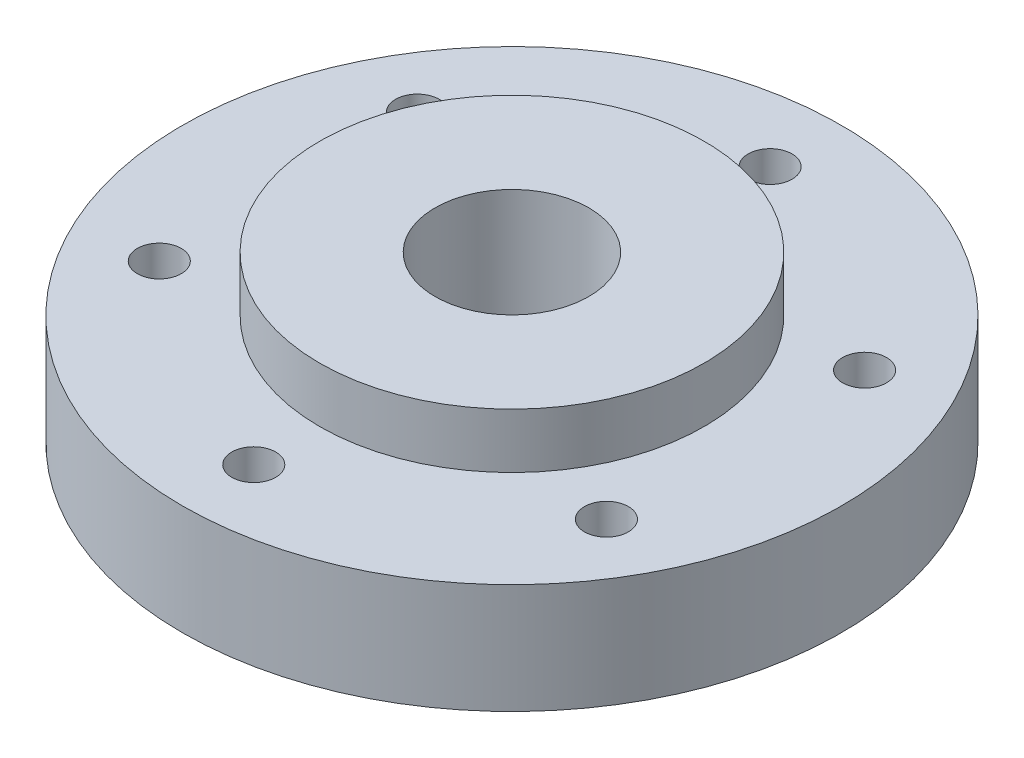
ISO-10303-21;
HEADER;
FILE_DESCRIPTION(('STEP AP214'),'2;1');
FILE_NAME('part.step','',(''),(''),'','','');
FILE_SCHEMA(('AUTOMOTIVE_DESIGN { 1 0 10303 214 1 1 1 1 }'));
ENDSEC;
DATA;
#1=APPLICATION_CONTEXT('core data for automotive mechanical design processes');
#2=APPLICATION_PROTOCOL_DEFINITION('international standard','automotive_design',2000,#1);
#3=PRODUCT_CONTEXT('',#1,'mechanical');
#4=PRODUCT('Part','Part','',(#3));
#5=PRODUCT_RELATED_PRODUCT_CATEGORY('part','',(#4));
#6=PRODUCT_DEFINITION_FORMATION('','',#4);
#7=PRODUCT_DEFINITION_CONTEXT('part definition',#1,'design');
#8=PRODUCT_DEFINITION('design','',#6,#7);
#9=PRODUCT_DEFINITION_SHAPE('','',#8);
#10=(LENGTH_UNIT() NAMED_UNIT(*) SI_UNIT(.MILLI.,.METRE.));
#11=(NAMED_UNIT(*) PLANE_ANGLE_UNIT() SI_UNIT($,.RADIAN.));
#12=(NAMED_UNIT(*) SI_UNIT($,.STERADIAN.) SOLID_ANGLE_UNIT());
#13=UNCERTAINTY_MEASURE_WITH_UNIT(LENGTH_MEASURE(1.E-05),#10,'distance_accuracy_value','');
#14=(GEOMETRIC_REPRESENTATION_CONTEXT(3) GLOBAL_UNCERTAINTY_ASSIGNED_CONTEXT((#13)) GLOBAL_UNIT_ASSIGNED_CONTEXT((#10,
#11,#12)) REPRESENTATION_CONTEXT('',''));
#15=CARTESIAN_POINT('',(0.,0.,0.));
#16=DIRECTION('',(0.,0.,1.));
#17=DIRECTION('',(1.,0.,0.));
#18=AXIS2_PLACEMENT_3D('',#15,#16,#17);
#19=CARTESIAN_POINT('',(0.,15.,0.));
#20=DIRECTION('',(0.,-1.,0.));
#21=DIRECTION('',(0.,0.,-1.));
#22=AXIS2_PLACEMENT_3D('',#19,#20,#21);
#23=CYLINDRICAL_SURFACE('',#22,30.);
#24=CARTESIAN_POINT('',(0.,0.,0.));
#25=DIRECTION('',(0.,1.,0.));
#26=DIRECTION('',(0.,0.,1.));
#27=AXIS2_PLACEMENT_3D('',#24,#25,#26);
#28=CIRCLE('',#27,30.);
#29=CARTESIAN_POINT('',(0.,0.,30.));
#30=VERTEX_POINT('',#29);
#31=EDGE_CURVE('E10',#30,#30,#28,.T.);
#32=ORIENTED_EDGE('',*,*,#31,.T.);
#33=EDGE_LOOP('',(#32));
#34=FACE_BOUND('',#33,.T.);
#35=CARTESIAN_POINT('',(0.,10.,0.));
#36=DIRECTION('',(0.,1.,0.));
#37=DIRECTION('',(0.,0.,1.));
#38=AXIS2_PLACEMENT_3D('',#35,#36,#37);
#39=CIRCLE('',#38,30.);
#40=CARTESIAN_POINT('',(0.,10.,30.));
#41=VERTEX_POINT('',#40);
#42=EDGE_CURVE('E53',#41,#41,#39,.T.);
#43=ORIENTED_EDGE('',*,*,#42,.F.);
#44=EDGE_LOOP('',(#43));
#45=FACE_BOUND('',#44,.T.);
#46=ADVANCED_FACE('F33',(#34,#45),#23,.T.);
#47=CARTESIAN_POINT('',(0.,15.,0.));
#48=DIRECTION('',(0.,1.,0.));
#49=DIRECTION('',(0.,0.,1.));
#50=AXIS2_PLACEMENT_3D('',#47,#48,#49);
#51=PLANE('',#50);
#52=CARTESIAN_POINT('',(0.,15.,0.));
#53=DIRECTION('',(0.,-1.,0.));
#54=DIRECTION('',(0.,0.,-1.));
#55=AXIS2_PLACEMENT_3D('',#52,#53,#54);
#56=CIRCLE('',#55,7.);
#57=CARTESIAN_POINT('',(0.,15.,-7.));
#58=VERTEX_POINT('',#57);
#59=EDGE_CURVE('E48',#58,#58,#56,.T.);
#60=ORIENTED_EDGE('',*,*,#59,.T.);
#61=EDGE_LOOP('',(#60));
#62=FACE_BOUND('',#61,.T.);
#63=CARTESIAN_POINT('',(0.,15.,0.));
#64=DIRECTION('',(0.,1.,0.));
#65=DIRECTION('',(0.,0.,1.));
#66=AXIS2_PLACEMENT_3D('',#63,#64,#65);
#67=CIRCLE('',#66,17.5);
#68=CARTESIAN_POINT('',(0.,15.,17.5));
#69=VERTEX_POINT('',#68);
#70=EDGE_CURVE('E59',#69,#69,#67,.T.);
#71=ORIENTED_EDGE('',*,*,#70,.T.);
#72=EDGE_LOOP('',(#71));
#73=FACE_BOUND('',#72,.T.);
#74=ADVANCED_FACE('F132',(#62,#73),#51,.T.);
#75=CARTESIAN_POINT('',(0.,0.,0.));
#76=DIRECTION('',(0.,1.,0.));
#77=DIRECTION('',(0.,0.,1.));
#78=AXIS2_PLACEMENT_3D('',#75,#76,#77);
#79=PLANE('',#78);
#80=CARTESIAN_POINT('',(20.3515969889348,0.,-11.7500000000009));
#81=DIRECTION('',(0.,1.,0.));
#82=DIRECTION('',(0.,0.,1.));
#83=AXIS2_PLACEMENT_3D('',#80,#81,#82);
#84=CIRCLE('',#83,2.00000000000028);
#85=CARTESIAN_POINT('',(20.3515969889348,0.,-9.75000000000058));
#86=VERTEX_POINT('',#85);
#87=EDGE_CURVE('E68',#86,#86,#84,.T.);
#88=ORIENTED_EDGE('',*,*,#87,.T.);
#89=EDGE_LOOP('',(#88));
#90=FACE_BOUND('',#89,.T.);
#91=CARTESIAN_POINT('',(20.3515969889358,0.,11.7499999999991));
#92=DIRECTION('',(0.,1.,0.));
#93=DIRECTION('',(0.,0.,1.));
#94=AXIS2_PLACEMENT_3D('',#91,#92,#93);
#95=CIRCLE('',#94,2.00000000000129);
#96=CARTESIAN_POINT('',(20.3515969889358,0.,13.7500000000004));
#97=VERTEX_POINT('',#96);
#98=EDGE_CURVE('E92',#97,#97,#95,.T.);
#99=ORIENTED_EDGE('',*,*,#98,.T.);
#100=EDGE_LOOP('',(#99));
#101=FACE_BOUND('',#100,.T.);
#102=CARTESIAN_POINT('',(1.99797467488749E-12,0.,23.5));
#103=DIRECTION('',(0.,1.,0.));
#104=DIRECTION('',(0.,0.,1.));
#105=AXIS2_PLACEMENT_3D('',#102,#103,#104);
#106=CIRCLE('',#105,2.00000000000207);
#107=CARTESIAN_POINT('',(1.99797467488749E-12,0.,25.5000000000021));
#108=VERTEX_POINT('',#107);
#109=EDGE_CURVE('E86',#108,#108,#106,.T.);
#110=ORIENTED_EDGE('',*,*,#109,.T.);
#111=EDGE_LOOP('',(#110));
#112=FACE_BOUND('',#111,.T.);
#113=CARTESIAN_POINT('',(-20.3515969889328,0.,11.7500000000009));
#114=DIRECTION('',(0.,1.,0.));
#115=DIRECTION('',(0.,0.,1.));
#116=AXIS2_PLACEMENT_3D('',#113,#114,#115);
#117=CIRCLE('',#116,2.0000000000019);
#118=CARTESIAN_POINT('',(-20.3515969889328,0.,13.7500000000028));
#119=VERTEX_POINT('',#118);
#120=EDGE_CURVE('E80',#119,#119,#117,.T.);
#121=ORIENTED_EDGE('',*,*,#120,.T.);
#122=EDGE_LOOP('',(#121));
#123=FACE_BOUND('',#122,.T.);
#124=CARTESIAN_POINT('',(-20.3515969889338,0.,-11.7499999999991));
#125=DIRECTION('',(0.,1.,0.));
#126=DIRECTION('',(0.,0.,1.));
#127=AXIS2_PLACEMENT_3D('',#124,#125,#126);
#128=CIRCLE('',#127,2.00000000000101);
#129=CARTESIAN_POINT('',(-20.3515969889338,0.,-9.74999999999811));
#130=VERTEX_POINT('',#129);
#131=EDGE_CURVE('E74',#130,#130,#128,.T.);
#132=ORIENTED_EDGE('',*,*,#131,.T.);
#133=EDGE_LOOP('',(#132));
#134=FACE_BOUND('',#133,.T.);
#135=CARTESIAN_POINT('',(0.,0.,-23.5));
#136=DIRECTION('',(0.,1.,0.));
#137=DIRECTION('',(0.,0.,1.));
#138=AXIS2_PLACEMENT_3D('',#135,#136,#137);
#139=CIRCLE('',#138,2.);
#140=CARTESIAN_POINT('',(0.,0.,-21.5));
#141=VERTEX_POINT('',#140);
#142=EDGE_CURVE('E62',#141,#141,#139,.T.);
#143=ORIENTED_EDGE('',*,*,#142,.T.);
#144=EDGE_LOOP('',(#143));
#145=FACE_BOUND('',#144,.T.);
#146=CARTESIAN_POINT('',(0.,0.,0.));
#147=DIRECTION('',(0.,-1.,0.));
#148=DIRECTION('',(0.,0.,-1.));
#149=AXIS2_PLACEMENT_3D('',#146,#147,#148);
#150=CIRCLE('',#149,16.25);
#151=CARTESIAN_POINT('',(0.,0.,-16.25));
#152=VERTEX_POINT('',#151);
#153=EDGE_CURVE('E43',#152,#152,#150,.T.);
#154=ORIENTED_EDGE('',*,*,#153,.F.);
#155=EDGE_LOOP('',(#154));
#156=FACE_BOUND('',#155,.T.);
#157=ORIENTED_EDGE('',*,*,#31,.F.);
#158=EDGE_LOOP('',(#157));
#159=FACE_BOUND('',#158,.T.);
#160=ADVANCED_FACE('F101',(#90,#101,#112,#123,#134,#145,#156,#159),#79,.F.);
#161=CARTESIAN_POINT('',(0.,5.,0.));
#162=DIRECTION('',(0.,-1.,0.));
#163=DIRECTION('',(0.,0.,-1.));
#164=AXIS2_PLACEMENT_3D('',#161,#162,#163);
#165=CYLINDRICAL_SURFACE('',#164,16.25);
#166=CARTESIAN_POINT('',(0.,5.,0.));
#167=DIRECTION('',(0.,-1.,0.));
#168=DIRECTION('',(0.,0.,-1.));
#169=AXIS2_PLACEMENT_3D('',#166,#167,#168);
#170=CIRCLE('',#169,16.25);
#171=CARTESIAN_POINT('',(0.,5.,-16.25));
#172=VERTEX_POINT('',#171);
#173=EDGE_CURVE('E39',#172,#172,#170,.T.);
#174=ORIENTED_EDGE('',*,*,#173,.F.);
#175=EDGE_LOOP('',(#174));
#176=FACE_BOUND('',#175,.T.);
#177=ORIENTED_EDGE('',*,*,#153,.T.);
#178=EDGE_LOOP('',(#177));
#179=FACE_BOUND('',#178,.T.);
#180=ADVANCED_FACE('F141',(#176,#179),#165,.F.);
#181=CARTESIAN_POINT('',(0.,5.,0.));
#182=DIRECTION('',(0.,-1.,0.));
#183=DIRECTION('',(0.,0.,-1.));
#184=AXIS2_PLACEMENT_3D('',#181,#182,#183);
#185=PLANE('',#184);
#186=CARTESIAN_POINT('',(0.,5.,0.));
#187=DIRECTION('',(0.,-1.,0.));
#188=DIRECTION('',(0.,0.,-1.));
#189=AXIS2_PLACEMENT_3D('',#186,#187,#188);
#190=CIRCLE('',#189,7.);
#191=CARTESIAN_POINT('',(0.,5.,-7.));
#192=VERTEX_POINT('',#191);
#193=EDGE_CURVE('E50',#192,#192,#190,.T.);
#194=ORIENTED_EDGE('',*,*,#193,.F.);
#195=EDGE_LOOP('',(#194));
#196=FACE_BOUND('',#195,.T.);
#197=ORIENTED_EDGE('',*,*,#173,.T.);
#198=EDGE_LOOP('',(#197));
#199=FACE_BOUND('',#198,.T.);
#200=ADVANCED_FACE('F146',(#196,#199),#185,.T.);
#201=CARTESIAN_POINT('',(0.,15.,0.));
#202=DIRECTION('',(0.,-1.,0.));
#203=DIRECTION('',(0.,0.,-1.));
#204=AXIS2_PLACEMENT_3D('',#201,#202,#203);
#205=CYLINDRICAL_SURFACE('',#204,7.);
#206=ORIENTED_EDGE('',*,*,#59,.F.);
#207=EDGE_LOOP('',(#206));
#208=FACE_BOUND('',#207,.T.);
#209=ORIENTED_EDGE('',*,*,#193,.T.);
#210=EDGE_LOOP('',(#209));
#211=FACE_BOUND('',#210,.T.);
#212=ADVANCED_FACE('F115',(#208,#211),#205,.F.);
#213=CARTESIAN_POINT('',(0.,10.,0.));
#214=DIRECTION('',(0.,1.,0.));
#215=DIRECTION('',(0.,0.,1.));
#216=AXIS2_PLACEMENT_3D('',#213,#214,#215);
#217=PLANE('',#216);
#218=CARTESIAN_POINT('',(20.3515969889348,10.,-11.7500000000009));
#219=DIRECTION('',(0.,1.,0.));
#220=DIRECTION('',(0.,0.,1.));
#221=AXIS2_PLACEMENT_3D('',#218,#219,#220);
#222=CIRCLE('',#221,2.00000000000028);
#223=CARTESIAN_POINT('',(20.3515969889348,10.,-9.75000000000058));
#224=VERTEX_POINT('',#223);
#225=EDGE_CURVE('E95',#224,#224,#222,.T.);
#226=ORIENTED_EDGE('',*,*,#225,.F.);
#227=EDGE_LOOP('',(#226));
#228=FACE_BOUND('',#227,.T.);
#229=CARTESIAN_POINT('',(20.3515969889358,10.,11.7499999999991));
#230=DIRECTION('',(0.,1.,0.));
#231=DIRECTION('',(0.,0.,1.));
#232=AXIS2_PLACEMENT_3D('',#229,#230,#231);
#233=CIRCLE('',#232,2.00000000000129);
#234=CARTESIAN_POINT('',(20.3515969889358,10.,13.7500000000004));
#235=VERTEX_POINT('',#234);
#236=EDGE_CURVE('E89',#235,#235,#233,.T.);
#237=ORIENTED_EDGE('',*,*,#236,.F.);
#238=EDGE_LOOP('',(#237));
#239=FACE_BOUND('',#238,.T.);
#240=CARTESIAN_POINT('',(1.99797467488749E-12,10.,23.5));
#241=DIRECTION('',(0.,1.,0.));
#242=DIRECTION('',(0.,0.,1.));
#243=AXIS2_PLACEMENT_3D('',#240,#241,#242);
#244=CIRCLE('',#243,2.00000000000207);
#245=CARTESIAN_POINT('',(1.99797467488749E-12,10.,25.5000000000021));
#246=VERTEX_POINT('',#245);
#247=EDGE_CURVE('E83',#246,#246,#244,.T.);
#248=ORIENTED_EDGE('',*,*,#247,.F.);
#249=EDGE_LOOP('',(#248));
#250=FACE_BOUND('',#249,.T.);
#251=CARTESIAN_POINT('',(-20.3515969889328,10.,11.7500000000009));
#252=DIRECTION('',(0.,1.,0.));
#253=DIRECTION('',(0.,0.,1.));
#254=AXIS2_PLACEMENT_3D('',#251,#252,#253);
#255=CIRCLE('',#254,2.0000000000019);
#256=CARTESIAN_POINT('',(-20.3515969889328,10.,13.7500000000028));
#257=VERTEX_POINT('',#256);
#258=EDGE_CURVE('E77',#257,#257,#255,.T.);
#259=ORIENTED_EDGE('',*,*,#258,.F.);
#260=EDGE_LOOP('',(#259));
#261=FACE_BOUND('',#260,.T.);
#262=CARTESIAN_POINT('',(-20.3515969889338,10.,-11.7499999999991));
#263=DIRECTION('',(0.,1.,0.));
#264=DIRECTION('',(0.,0.,1.));
#265=AXIS2_PLACEMENT_3D('',#262,#263,#264);
#266=CIRCLE('',#265,2.00000000000101);
#267=CARTESIAN_POINT('',(-20.3515969889338,10.,-9.74999999999811));
#268=VERTEX_POINT('',#267);
#269=EDGE_CURVE('E71',#268,#268,#266,.T.);
#270=ORIENTED_EDGE('',*,*,#269,.F.);
#271=EDGE_LOOP('',(#270));
#272=FACE_BOUND('',#271,.T.);
#273=CARTESIAN_POINT('',(0.,10.,-23.5));
#274=DIRECTION('',(0.,1.,0.));
#275=DIRECTION('',(0.,0.,1.));
#276=AXIS2_PLACEMENT_3D('',#273,#274,#275);
#277=CIRCLE('',#276,2.);
#278=CARTESIAN_POINT('',(0.,10.,-21.5));
#279=VERTEX_POINT('',#278);
#280=EDGE_CURVE('E65',#279,#279,#277,.T.);
#281=ORIENTED_EDGE('',*,*,#280,.F.);
#282=EDGE_LOOP('',(#281));
#283=FACE_BOUND('',#282,.T.);
#284=CARTESIAN_POINT('',(0.,10.,0.));
#285=DIRECTION('',(0.,1.,0.));
#286=DIRECTION('',(0.,0.,1.));
#287=AXIS2_PLACEMENT_3D('',#284,#285,#286);
#288=CIRCLE('',#287,17.5);
#289=CARTESIAN_POINT('',(0.,10.,17.5));
#290=VERTEX_POINT('',#289);
#291=EDGE_CURVE('E58',#290,#290,#288,.T.);
#292=ORIENTED_EDGE('',*,*,#291,.F.);
#293=EDGE_LOOP('',(#292));
#294=FACE_BOUND('',#293,.T.);
#295=ORIENTED_EDGE('',*,*,#42,.T.);
#296=EDGE_LOOP('',(#295));
#297=FACE_BOUND('',#296,.T.);
#298=ADVANCED_FACE('F111',(#228,#239,#250,#261,#272,#283,#294,#297),#217,.T.);
#299=CARTESIAN_POINT('',(0.,10.,0.));
#300=DIRECTION('',(0.,1.,0.));
#301=DIRECTION('',(0.,0.,1.));
#302=AXIS2_PLACEMENT_3D('',#299,#300,#301);
#303=CYLINDRICAL_SURFACE('',#302,17.5);
#304=ORIENTED_EDGE('',*,*,#291,.T.);
#305=EDGE_LOOP('',(#304));
#306=FACE_BOUND('',#305,.T.);
#307=ORIENTED_EDGE('',*,*,#70,.F.);
#308=EDGE_LOOP('',(#307));
#309=FACE_BOUND('',#308,.T.);
#310=ADVANCED_FACE('F114',(#306,#309),#303,.T.);
#311=CARTESIAN_POINT('',(0.,0.,-23.5));
#312=DIRECTION('',(0.,1.,0.));
#313=DIRECTION('',(0.,0.,1.));
#314=AXIS2_PLACEMENT_3D('',#311,#312,#313);
#315=CYLINDRICAL_SURFACE('',#314,2.);
#316=ORIENTED_EDGE('',*,*,#142,.F.);
#317=EDGE_LOOP('',(#316));
#318=FACE_BOUND('',#317,.T.);
#319=ORIENTED_EDGE('',*,*,#280,.T.);
#320=EDGE_LOOP('',(#319));
#321=FACE_BOUND('',#320,.T.);
#322=ADVANCED_FACE('F156',(#318,#321),#315,.F.);
#323=CARTESIAN_POINT('',(-20.3515969889338,0.,-11.7499999999991));
#324=DIRECTION('',(0.,1.,0.));
#325=DIRECTION('',(0.,0.,1.));
#326=AXIS2_PLACEMENT_3D('',#323,#324,#325);
#327=CYLINDRICAL_SURFACE('',#326,2.00000000000101);
#328=ORIENTED_EDGE('',*,*,#131,.F.);
#329=EDGE_LOOP('',(#328));
#330=FACE_BOUND('',#329,.T.);
#331=ORIENTED_EDGE('',*,*,#269,.T.);
#332=EDGE_LOOP('',(#331));
#333=FACE_BOUND('',#332,.T.);
#334=ADVANCED_FACE('F160',(#330,#333),#327,.F.);
#335=CARTESIAN_POINT('',(-20.3515969889328,0.,11.7500000000009));
#336=DIRECTION('',(0.,1.,0.));
#337=DIRECTION('',(0.,0.,1.));
#338=AXIS2_PLACEMENT_3D('',#335,#336,#337);
#339=CYLINDRICAL_SURFACE('',#338,2.0000000000019);
#340=ORIENTED_EDGE('',*,*,#120,.F.);
#341=EDGE_LOOP('',(#340));
#342=FACE_BOUND('',#341,.T.);
#343=ORIENTED_EDGE('',*,*,#258,.T.);
#344=EDGE_LOOP('',(#343));
#345=FACE_BOUND('',#344,.T.);
#346=ADVANCED_FACE('F164',(#342,#345),#339,.F.);
#347=CARTESIAN_POINT('',(1.99797467488749E-12,0.,23.5));
#348=DIRECTION('',(0.,1.,0.));
#349=DIRECTION('',(0.,0.,1.));
#350=AXIS2_PLACEMENT_3D('',#347,#348,#349);
#351=CYLINDRICAL_SURFACE('',#350,2.00000000000207);
#352=ORIENTED_EDGE('',*,*,#109,.F.);
#353=EDGE_LOOP('',(#352));
#354=FACE_BOUND('',#353,.T.);
#355=ORIENTED_EDGE('',*,*,#247,.T.);
#356=EDGE_LOOP('',(#355));
#357=FACE_BOUND('',#356,.T.);
#358=ADVANCED_FACE('F168',(#354,#357),#351,.F.);
#359=CARTESIAN_POINT('',(20.3515969889358,0.,11.7499999999991));
#360=DIRECTION('',(0.,1.,0.));
#361=DIRECTION('',(0.,0.,1.));
#362=AXIS2_PLACEMENT_3D('',#359,#360,#361);
#363=CYLINDRICAL_SURFACE('',#362,2.00000000000129);
#364=ORIENTED_EDGE('',*,*,#98,.F.);
#365=EDGE_LOOP('',(#364));
#366=FACE_BOUND('',#365,.T.);
#367=ORIENTED_EDGE('',*,*,#236,.T.);
#368=EDGE_LOOP('',(#367));
#369=FACE_BOUND('',#368,.T.);
#370=ADVANCED_FACE('F107',(#366,#369),#363,.F.);
#371=CARTESIAN_POINT('',(20.3515969889348,0.,-11.7500000000009));
#372=DIRECTION('',(0.,1.,0.));
#373=DIRECTION('',(0.,0.,1.));
#374=AXIS2_PLACEMENT_3D('',#371,#372,#373);
#375=CYLINDRICAL_SURFACE('',#374,2.00000000000028);
#376=ORIENTED_EDGE('',*,*,#87,.F.);
#377=EDGE_LOOP('',(#376));
#378=FACE_BOUND('',#377,.T.);
#379=ORIENTED_EDGE('',*,*,#225,.T.);
#380=EDGE_LOOP('',(#379));
#381=FACE_BOUND('',#380,.T.);
#382=ADVANCED_FACE('F104',(#378,#381),#375,.F.);
#383=CLOSED_SHELL('',(#46,#74,#160,#180,#200,#212,#298,#310,#322,#334,#346,#358,#370,#382));
#384=MANIFOLD_SOLID_BREP('B2',#383);
#385=ADVANCED_BREP_SHAPE_REPRESENTATION('',(#18,#384),#14);
#386=SHAPE_DEFINITION_REPRESENTATION(#9,#385);
ENDSEC;
END-ISO-10303-21;
